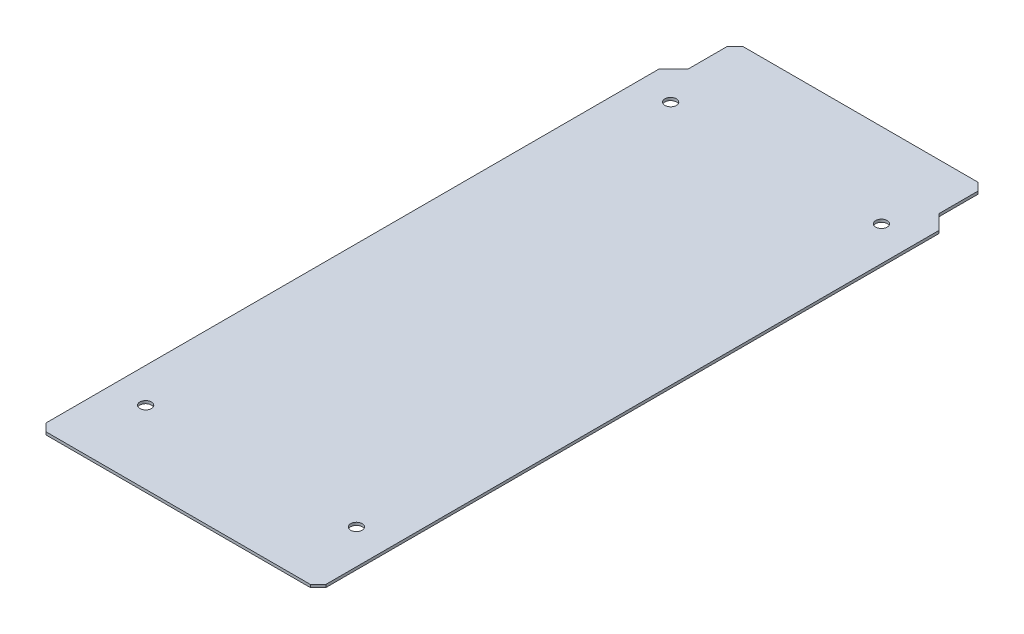
ISO-10303-21;
HEADER;
FILE_DESCRIPTION(('STEP AP214'),'2;1');
FILE_NAME('part.step','',(''),(''),'','','');
FILE_SCHEMA(('AUTOMOTIVE_DESIGN { 1 0 10303 214 1 1 1 1 }'));
ENDSEC;
DATA;
#1=APPLICATION_CONTEXT('core data for automotive mechanical design processes');
#2=APPLICATION_PROTOCOL_DEFINITION('international standard','automotive_design',2000,#1);
#3=PRODUCT_CONTEXT('',#1,'mechanical');
#4=PRODUCT('Part','Part','',(#3));
#5=PRODUCT_RELATED_PRODUCT_CATEGORY('part','',(#4));
#6=PRODUCT_DEFINITION_FORMATION('','',#4);
#7=PRODUCT_DEFINITION_CONTEXT('part definition',#1,'design');
#8=PRODUCT_DEFINITION('design','',#6,#7);
#9=PRODUCT_DEFINITION_SHAPE('','',#8);
#10=(LENGTH_UNIT() NAMED_UNIT(*) SI_UNIT(.MILLI.,.METRE.));
#11=(NAMED_UNIT(*) PLANE_ANGLE_UNIT() SI_UNIT($,.RADIAN.));
#12=(NAMED_UNIT(*) SI_UNIT($,.STERADIAN.) SOLID_ANGLE_UNIT());
#13=UNCERTAINTY_MEASURE_WITH_UNIT(LENGTH_MEASURE(1.E-05),#10,'distance_accuracy_value','');
#14=(GEOMETRIC_REPRESENTATION_CONTEXT(3) GLOBAL_UNCERTAINTY_ASSIGNED_CONTEXT((#13)) GLOBAL_UNIT_ASSIGNED_CONTEXT((#10,
#11,#12)) REPRESENTATION_CONTEXT('',''));
#15=CARTESIAN_POINT('',(0.,0.,0.));
#16=DIRECTION('',(0.,0.,1.));
#17=DIRECTION('',(1.,0.,0.));
#18=AXIS2_PLACEMENT_3D('',#15,#16,#17);
#19=CARTESIAN_POINT('',(0.,0.,0.));
#20=DIRECTION('',(0.,-1.,0.));
#21=DIRECTION('',(0.,0.,-1.));
#22=AXIS2_PLACEMENT_3D('',#19,#20,#21);
#23=PLANE('',#22);
#24=CARTESIAN_POINT('',(34.925,0.,-199.39));
#25=DIRECTION('',(0.,1.,0.));
#26=DIRECTION('',(0.,0.,-1.));
#27=AXIS2_PLACEMENT_3D('',#24,#25,#26);
#28=CIRCLE('',#27,1.905);
#29=CARTESIAN_POINT('',(34.925,0.,-201.295));
#30=VERTEX_POINT('',#29);
#31=EDGE_CURVE('E177',#30,#30,#28,.T.);
#32=ORIENTED_EDGE('',*,*,#31,.T.);
#33=EDGE_LOOP('',(#32));
#34=FACE_BOUND('',#33,.T.);
#35=CARTESIAN_POINT('',(-34.925,0.,-25.4));
#36=DIRECTION('',(0.,1.,0.));
#37=DIRECTION('',(0.,0.,1.));
#38=AXIS2_PLACEMENT_3D('',#35,#36,#37);
#39=CIRCLE('',#38,1.905);
#40=CARTESIAN_POINT('',(-34.925,0.,-23.495));
#41=VERTEX_POINT('',#40);
#42=EDGE_CURVE('E180',#41,#41,#39,.T.);
#43=ORIENTED_EDGE('',*,*,#42,.T.);
#44=EDGE_LOOP('',(#43));
#45=FACE_BOUND('',#44,.T.);
#46=CARTESIAN_POINT('',(-34.925,0.,-199.39));
#47=DIRECTION('',(0.,1.,0.));
#48=DIRECTION('',(0.,0.,1.));
#49=AXIS2_PLACEMENT_3D('',#46,#47,#48);
#50=CIRCLE('',#49,1.905);
#51=CARTESIAN_POINT('',(-34.925,0.,-197.485));
#52=VERTEX_POINT('',#51);
#53=EDGE_CURVE('E193',#52,#52,#50,.T.);
#54=ORIENTED_EDGE('',*,*,#53,.T.);
#55=EDGE_LOOP('',(#54));
#56=FACE_BOUND('',#55,.T.);
#57=CARTESIAN_POINT('',(34.925,0.,-25.4));
#58=DIRECTION('',(0.,1.,0.));
#59=DIRECTION('',(0.,0.,-1.));
#60=AXIS2_PLACEMENT_3D('',#57,#58,#59);
#61=CIRCLE('',#60,1.905);
#62=CARTESIAN_POINT('',(34.925,0.,-27.305));
#63=VERTEX_POINT('',#62);
#64=EDGE_CURVE('E196',#63,#63,#61,.T.);
#65=ORIENTED_EDGE('',*,*,#64,.T.);
#66=EDGE_LOOP('',(#65));
#67=FACE_BOUND('',#66,.T.);
#68=DIRECTION('',(0.,0.,1.));
#69=VECTOR('',#68,1.);
#70=CARTESIAN_POINT('',(-46.355,0.,0.));
#71=LINE('',#70,#69);
#72=CARTESIAN_POINT('',(-46.355,0.,-207.01));
#73=VERTEX_POINT('',#72);
#74=CARTESIAN_POINT('',(-46.355,0.,-3.81000000000004));
#75=VERTEX_POINT('',#74);
#76=EDGE_CURVE('E184',#73,#75,#71,.T.);
#77=ORIENTED_EDGE('',*,*,#76,.F.);
#78=DIRECTION('',(-0.707106781186548,0.,0.707106781186548));
#79=VECTOR('',#78,1.);
#80=CARTESIAN_POINT('',(-126.6825,0.,-126.6825));
#81=LINE('',#80,#79);
#82=CARTESIAN_POINT('',(-41.529,0.,-211.836));
#83=VERTEX_POINT('',#82);
#84=EDGE_CURVE('E159',#83,#73,#81,.T.);
#85=ORIENTED_EDGE('',*,*,#84,.F.);
#86=DIRECTION('',(0.,0.,1.));
#87=VECTOR('',#86,1.);
#88=CARTESIAN_POINT('',(-41.529,0.,-227.33));
#89=LINE('',#88,#87);
#90=CARTESIAN_POINT('',(-41.529,0.,-224.79));
#91=VERTEX_POINT('',#90);
#92=EDGE_CURVE('E142',#91,#83,#89,.T.);
#93=ORIENTED_EDGE('',*,*,#92,.F.);
#94=DIRECTION('',(-0.707106781186546,0.,0.707106781186549));
#95=VECTOR('',#94,1.);
#96=CARTESIAN_POINT('',(-133.1595,0.,-133.159499999999));
#97=LINE('',#96,#95);
#98=CARTESIAN_POINT('',(-38.9889999999999,0.,-227.33));
#99=VERTEX_POINT('',#98);
#100=EDGE_CURVE('E132',#99,#91,#97,.T.);
#101=ORIENTED_EDGE('',*,*,#100,.F.);
#102=DIRECTION('',(-1.,0.,0.));
#103=VECTOR('',#102,1.);
#104=CARTESIAN_POINT('',(-46.355,0.,-227.33));
#105=LINE('',#104,#103);
#106=CARTESIAN_POINT('',(38.9889999999999,0.,-227.33));
#107=VERTEX_POINT('',#106);
#108=EDGE_CURVE('E186',#107,#99,#105,.T.);
#109=ORIENTED_EDGE('',*,*,#108,.F.);
#110=DIRECTION('',(0.707106781186546,0.,0.707106781186549));
#111=VECTOR('',#110,1.);
#112=CARTESIAN_POINT('',(133.1595,0.,-133.159499999999));
#113=LINE('',#112,#111);
#114=CARTESIAN_POINT('',(41.529,0.,-224.79));
#115=VERTEX_POINT('',#114);
#116=EDGE_CURVE('E220',#107,#115,#113,.T.);
#117=ORIENTED_EDGE('',*,*,#116,.T.);
#118=DIRECTION('',(0.,0.,1.));
#119=VECTOR('',#118,1.);
#120=CARTESIAN_POINT('',(41.529,0.,-227.33));
#121=LINE('',#120,#119);
#122=CARTESIAN_POINT('',(41.529,0.,-211.836));
#123=VERTEX_POINT('',#122);
#124=EDGE_CURVE('E170',#115,#123,#121,.T.);
#125=ORIENTED_EDGE('',*,*,#124,.T.);
#126=DIRECTION('',(0.707106781186548,0.,0.707106781186548));
#127=VECTOR('',#126,1.);
#128=CARTESIAN_POINT('',(126.6825,0.,-126.6825));
#129=LINE('',#128,#127);
#130=CARTESIAN_POINT('',(46.355,0.,-207.01));
#131=VERTEX_POINT('',#130);
#132=EDGE_CURVE('E222',#123,#131,#129,.T.);
#133=ORIENTED_EDGE('',*,*,#132,.T.);
#134=DIRECTION('',(0.,0.,-1.));
#135=VECTOR('',#134,1.);
#136=CARTESIAN_POINT('',(46.355,0.,0.));
#137=LINE('',#136,#135);
#138=CARTESIAN_POINT('',(46.355,0.,-3.81000000000004));
#139=VERTEX_POINT('',#138);
#140=EDGE_CURVE('E189',#139,#131,#137,.T.);
#141=ORIENTED_EDGE('',*,*,#140,.F.);
#142=DIRECTION('',(0.707106781186551,0.,-0.707106781186544));
#143=VECTOR('',#142,1.);
#144=CARTESIAN_POINT('',(21.2724999999997,0.,21.2725));
#145=LINE('',#144,#143);
#146=CARTESIAN_POINT('',(43.8149999999999,0.,-1.27));
#147=VERTEX_POINT('',#146);
#148=EDGE_CURVE('E199',#139,#147,#145,.F.);
#149=ORIENTED_EDGE('',*,*,#148,.T.);
#150=DIRECTION('',(-1.,0.,0.));
#151=VECTOR('',#150,1.);
#152=CARTESIAN_POINT('',(-46.355,0.,-1.27));
#153=LINE('',#152,#151);
#154=CARTESIAN_POINT('',(-43.8149999999999,0.,-1.27));
#155=VERTEX_POINT('',#154);
#156=EDGE_CURVE('E192',#155,#147,#153,.F.);
#157=ORIENTED_EDGE('',*,*,#156,.F.);
#158=DIRECTION('',(-0.707106781186551,0.,-0.707106781186544));
#159=VECTOR('',#158,1.);
#160=CARTESIAN_POINT('',(-21.2724999999997,0.,21.2725));
#161=LINE('',#160,#159);
#162=EDGE_CURVE('E165',#75,#155,#161,.F.);
#163=ORIENTED_EDGE('',*,*,#162,.F.);
#164=EDGE_LOOP('',(#77,#85,#93,#101,#109,#117,#125,#133,#141,#149,#157,#163));
#165=FACE_BOUND('',#164,.T.);
#166=ADVANCED_FACE('F39',(#34,#45,#56,#67,#165),#23,.T.);
#167=CARTESIAN_POINT('',(0.,0.9144,0.));
#168=DIRECTION('',(0.,-1.,0.));
#169=DIRECTION('',(0.,0.,-1.));
#170=AXIS2_PLACEMENT_3D('',#167,#168,#169);
#171=PLANE('',#170);
#172=CARTESIAN_POINT('',(34.925,0.9144,-25.4));
#173=DIRECTION('',(0.,1.,0.));
#174=DIRECTION('',(0.,0.,1.));
#175=AXIS2_PLACEMENT_3D('',#172,#173,#174);
#176=CIRCLE('',#175,1.905);
#177=CARTESIAN_POINT('',(34.925,0.9144,-23.495));
#178=VERTEX_POINT('',#177);
#179=EDGE_CURVE('E181',#178,#178,#176,.T.);
#180=ORIENTED_EDGE('',*,*,#179,.F.);
#181=EDGE_LOOP('',(#180));
#182=FACE_BOUND('',#181,.T.);
#183=CARTESIAN_POINT('',(-34.925,0.9144,-199.39));
#184=DIRECTION('',(0.,1.,0.));
#185=DIRECTION('',(0.,0.,1.));
#186=AXIS2_PLACEMENT_3D('',#183,#184,#185);
#187=CIRCLE('',#186,1.905);
#188=CARTESIAN_POINT('',(-34.925,0.9144,-197.485));
#189=VERTEX_POINT('',#188);
#190=EDGE_CURVE('E211',#189,#189,#187,.T.);
#191=ORIENTED_EDGE('',*,*,#190,.F.);
#192=EDGE_LOOP('',(#191));
#193=FACE_BOUND('',#192,.T.);
#194=CARTESIAN_POINT('',(-34.925,0.9144,-25.4));
#195=DIRECTION('',(0.,1.,0.));
#196=DIRECTION('',(0.,0.,1.));
#197=AXIS2_PLACEMENT_3D('',#194,#195,#196);
#198=CIRCLE('',#197,1.905);
#199=CARTESIAN_POINT('',(-34.925,0.9144,-23.495));
#200=VERTEX_POINT('',#199);
#201=EDGE_CURVE('E202',#200,#200,#198,.T.);
#202=ORIENTED_EDGE('',*,*,#201,.F.);
#203=EDGE_LOOP('',(#202));
#204=FACE_BOUND('',#203,.T.);
#205=CARTESIAN_POINT('',(34.925,0.9144,-199.39));
#206=DIRECTION('',(0.,1.,0.));
#207=DIRECTION('',(0.,0.,1.));
#208=AXIS2_PLACEMENT_3D('',#205,#206,#207);
#209=CIRCLE('',#208,1.905);
#210=CARTESIAN_POINT('',(34.925,0.9144,-197.485));
#211=VERTEX_POINT('',#210);
#212=EDGE_CURVE('E174',#211,#211,#209,.T.);
#213=ORIENTED_EDGE('',*,*,#212,.F.);
#214=EDGE_LOOP('',(#213));
#215=FACE_BOUND('',#214,.T.);
#216=DIRECTION('',(0.707106781186548,0.,-0.707106781186548));
#217=VECTOR('',#216,1.);
#218=CARTESIAN_POINT('',(-43.815,0.9144,-209.55));
#219=LINE('',#218,#217);
#220=CARTESIAN_POINT('',(-46.355,0.9144,-207.01));
#221=VERTEX_POINT('',#220);
#222=CARTESIAN_POINT('',(-41.529,0.9144,-211.836));
#223=VERTEX_POINT('',#222);
#224=EDGE_CURVE('E155',#221,#223,#219,.T.);
#225=ORIENTED_EDGE('',*,*,#224,.F.);
#226=DIRECTION('',(0.,0.,-1.));
#227=VECTOR('',#226,1.);
#228=CARTESIAN_POINT('',(-46.355,0.9144,0.));
#229=LINE('',#228,#227);
#230=CARTESIAN_POINT('',(-46.355,0.9144,-3.81000000000004));
#231=VERTEX_POINT('',#230);
#232=EDGE_CURVE('E62',#221,#231,#229,.F.);
#233=ORIENTED_EDGE('',*,*,#232,.T.);
#234=DIRECTION('',(0.707106781186551,0.,0.707106781186544));
#235=VECTOR('',#234,1.);
#236=CARTESIAN_POINT('',(-46.355,0.9144,-3.81000000000004));
#237=LINE('',#236,#235);
#238=CARTESIAN_POINT('',(-43.8149999999999,0.9144,-1.27));
#239=VERTEX_POINT('',#238);
#240=EDGE_CURVE('E161',#239,#231,#237,.F.);
#241=ORIENTED_EDGE('',*,*,#240,.F.);
#242=DIRECTION('',(-1.,0.,0.));
#243=VECTOR('',#242,1.);
#244=CARTESIAN_POINT('',(-46.355,0.9144,-1.27));
#245=LINE('',#244,#243);
#246=CARTESIAN_POINT('',(43.8149999999999,0.9144,-1.27));
#247=VERTEX_POINT('',#246);
#248=EDGE_CURVE('E209',#239,#247,#245,.F.);
#249=ORIENTED_EDGE('',*,*,#248,.T.);
#250=DIRECTION('',(-0.707106781186551,0.,0.707106781186544));
#251=VECTOR('',#250,1.);
#252=CARTESIAN_POINT('',(46.355,0.9144,-3.81000000000004));
#253=LINE('',#252,#251);
#254=CARTESIAN_POINT('',(46.355,0.9144,-3.81000000000004));
#255=VERTEX_POINT('',#254);
#256=EDGE_CURVE('E229',#247,#255,#253,.F.);
#257=ORIENTED_EDGE('',*,*,#256,.T.);
#258=DIRECTION('',(0.,0.,-1.));
#259=VECTOR('',#258,1.);
#260=CARTESIAN_POINT('',(46.355,0.9144,0.));
#261=LINE('',#260,#259);
#262=CARTESIAN_POINT('',(46.355,0.9144,-207.01));
#263=VERTEX_POINT('',#262);
#264=EDGE_CURVE('E206',#255,#263,#261,.T.);
#265=ORIENTED_EDGE('',*,*,#264,.T.);
#266=DIRECTION('',(-0.707106781186548,0.,-0.707106781186548));
#267=VECTOR('',#266,1.);
#268=CARTESIAN_POINT('',(43.815,0.9144,-209.55));
#269=LINE('',#268,#267);
#270=CARTESIAN_POINT('',(41.529,0.9144,-211.836));
#271=VERTEX_POINT('',#270);
#272=EDGE_CURVE('E233',#263,#271,#269,.T.);
#273=ORIENTED_EDGE('',*,*,#272,.T.);
#274=DIRECTION('',(0.,0.,1.));
#275=VECTOR('',#274,1.);
#276=CARTESIAN_POINT('',(41.529,0.9144,-227.33));
#277=LINE('',#276,#275);
#278=CARTESIAN_POINT('',(41.529,0.9144,-224.79));
#279=VERTEX_POINT('',#278);
#280=EDGE_CURVE('E171',#279,#271,#277,.T.);
#281=ORIENTED_EDGE('',*,*,#280,.F.);
#282=DIRECTION('',(-0.707106781186546,0.,-0.707106781186549));
#283=VECTOR('',#282,1.);
#284=CARTESIAN_POINT('',(38.989,0.9144,-227.33));
#285=LINE('',#284,#283);
#286=CARTESIAN_POINT('',(38.989,0.9144,-227.33));
#287=VERTEX_POINT('',#286);
#288=EDGE_CURVE('E231',#279,#287,#285,.T.);
#289=ORIENTED_EDGE('',*,*,#288,.T.);
#290=DIRECTION('',(1.,0.,0.));
#291=VECTOR('',#290,1.);
#292=CARTESIAN_POINT('',(0.,0.9144,-227.33));
#293=LINE('',#292,#291);
#294=CARTESIAN_POINT('',(-38.989,0.9144,-227.33));
#295=VERTEX_POINT('',#294);
#296=EDGE_CURVE('E147',#287,#295,#293,.F.);
#297=ORIENTED_EDGE('',*,*,#296,.T.);
#298=DIRECTION('',(0.707106781186546,0.,-0.707106781186549));
#299=VECTOR('',#298,1.);
#300=CARTESIAN_POINT('',(-38.989,0.9144,-227.33));
#301=LINE('',#300,#299);
#302=CARTESIAN_POINT('',(-41.529,0.9144,-224.79));
#303=VERTEX_POINT('',#302);
#304=EDGE_CURVE('E54',#303,#295,#301,.T.);
#305=ORIENTED_EDGE('',*,*,#304,.F.);
#306=DIRECTION('',(0.,0.,1.));
#307=VECTOR('',#306,1.);
#308=CARTESIAN_POINT('',(-41.529,0.9144,-227.33));
#309=LINE('',#308,#307);
#310=EDGE_CURVE('E138',#303,#223,#309,.T.);
#311=ORIENTED_EDGE('',*,*,#310,.T.);
#312=EDGE_LOOP('',(#225,#233,#241,#249,#257,#265,#273,#281,#289,#297,#305,#311));
#313=FACE_BOUND('',#312,.T.);
#314=ADVANCED_FACE('F145',(#182,#193,#204,#215,#313),#171,.F.);
#315=CARTESIAN_POINT('',(-46.355,0.,0.));
#316=DIRECTION('',(1.,0.,0.));
#317=DIRECTION('',(0.,0.,1.));
#318=AXIS2_PLACEMENT_3D('',#315,#316,#317);
#319=PLANE('',#318);
#320=ORIENTED_EDGE('',*,*,#232,.F.);
#321=DIRECTION('',(0.,-1.,0.));
#322=VECTOR('',#321,1.);
#323=CARTESIAN_POINT('',(-46.355,0.,-207.01));
#324=LINE('',#323,#322);
#325=EDGE_CURVE('E157',#73,#221,#324,.F.);
#326=ORIENTED_EDGE('',*,*,#325,.F.);
#327=ORIENTED_EDGE('',*,*,#76,.T.);
#328=DIRECTION('',(0.,1.,0.));
#329=VECTOR('',#328,1.);
#330=CARTESIAN_POINT('',(-46.355,0.,-3.81000000000004));
#331=LINE('',#330,#329);
#332=EDGE_CURVE('E167',#231,#75,#331,.F.);
#333=ORIENTED_EDGE('',*,*,#332,.F.);
#334=EDGE_LOOP('',(#320,#326,#327,#333));
#335=FACE_BOUND('',#334,.T.);
#336=ADVANCED_FACE('F277',(#335),#319,.F.);
#337=CARTESIAN_POINT('',(-46.355,0.,-227.33));
#338=DIRECTION('',(0.,0.,1.));
#339=DIRECTION('',(-1.,0.,0.));
#340=AXIS2_PLACEMENT_3D('',#337,#338,#339);
#341=PLANE('',#340);
#342=ORIENTED_EDGE('',*,*,#108,.T.);
#343=DIRECTION('',(0.,1.,0.));
#344=VECTOR('',#343,1.);
#345=CARTESIAN_POINT('',(-38.989,0.,-227.33));
#346=LINE('',#345,#344);
#347=EDGE_CURVE('E151',#295,#99,#346,.F.);
#348=ORIENTED_EDGE('',*,*,#347,.F.);
#349=ORIENTED_EDGE('',*,*,#296,.F.);
#350=DIRECTION('',(0.,1.,0.));
#351=VECTOR('',#350,1.);
#352=CARTESIAN_POINT('',(38.989,0.,-227.33));
#353=LINE('',#352,#351);
#354=EDGE_CURVE('E235',#287,#107,#353,.F.);
#355=ORIENTED_EDGE('',*,*,#354,.T.);
#356=EDGE_LOOP('',(#342,#348,#349,#355));
#357=FACE_BOUND('',#356,.T.);
#358=ADVANCED_FACE('F267',(#357),#341,.F.);
#359=CARTESIAN_POINT('',(-46.355,0.,-1.27));
#360=DIRECTION('',(0.,0.,-1.));
#361=DIRECTION('',(1.,0.,0.));
#362=AXIS2_PLACEMENT_3D('',#359,#360,#361);
#363=PLANE('',#362);
#364=ORIENTED_EDGE('',*,*,#248,.F.);
#365=DIRECTION('',(0.,-1.,0.));
#366=VECTOR('',#365,1.);
#367=CARTESIAN_POINT('',(-43.8149999999999,0.,-1.27));
#368=LINE('',#367,#366);
#369=EDGE_CURVE('E163',#155,#239,#368,.F.);
#370=ORIENTED_EDGE('',*,*,#369,.F.);
#371=ORIENTED_EDGE('',*,*,#156,.T.);
#372=DIRECTION('',(0.,-1.,0.));
#373=VECTOR('',#372,1.);
#374=CARTESIAN_POINT('',(43.8149999999999,0.,-1.27));
#375=LINE('',#374,#373);
#376=EDGE_CURVE('E47',#147,#247,#375,.F.);
#377=ORIENTED_EDGE('',*,*,#376,.T.);
#378=EDGE_LOOP('',(#364,#370,#371,#377));
#379=FACE_BOUND('',#378,.T.);
#380=ADVANCED_FACE('F244',(#379),#363,.F.);
#381=CARTESIAN_POINT('',(46.355,0.,0.));
#382=DIRECTION('',(-1.,0.,0.));
#383=DIRECTION('',(0.,0.,-1.));
#384=AXIS2_PLACEMENT_3D('',#381,#382,#383);
#385=PLANE('',#384);
#386=ORIENTED_EDGE('',*,*,#140,.T.);
#387=DIRECTION('',(0.,-1.,0.));
#388=VECTOR('',#387,1.);
#389=CARTESIAN_POINT('',(46.355,0.,-207.01));
#390=LINE('',#389,#388);
#391=EDGE_CURVE('E227',#131,#263,#390,.F.);
#392=ORIENTED_EDGE('',*,*,#391,.T.);
#393=ORIENTED_EDGE('',*,*,#264,.F.);
#394=DIRECTION('',(0.,1.,0.));
#395=VECTOR('',#394,1.);
#396=CARTESIAN_POINT('',(46.355,0.,-3.81000000000004));
#397=LINE('',#396,#395);
#398=EDGE_CURVE('E224',#255,#139,#397,.F.);
#399=ORIENTED_EDGE('',*,*,#398,.T.);
#400=EDGE_LOOP('',(#386,#392,#393,#399));
#401=FACE_BOUND('',#400,.T.);
#402=ADVANCED_FACE('F252',(#401),#385,.F.);
#403=CARTESIAN_POINT('',(34.925,0.,-199.39));
#404=DIRECTION('',(0.,1.,0.));
#405=DIRECTION('',(0.,0.,1.));
#406=AXIS2_PLACEMENT_3D('',#403,#404,#405);
#407=CYLINDRICAL_SURFACE('',#406,1.905);
#408=ORIENTED_EDGE('',*,*,#31,.F.);
#409=EDGE_LOOP('',(#408));
#410=FACE_BOUND('',#409,.T.);
#411=ORIENTED_EDGE('',*,*,#212,.T.);
#412=EDGE_LOOP('',(#411));
#413=FACE_BOUND('',#412,.T.);
#414=ADVANCED_FACE('F304',(#410,#413),#407,.F.);
#415=CARTESIAN_POINT('',(-34.925,0.,-25.4));
#416=DIRECTION('',(0.,1.,0.));
#417=DIRECTION('',(0.,0.,1.));
#418=AXIS2_PLACEMENT_3D('',#415,#416,#417);
#419=CYLINDRICAL_SURFACE('',#418,1.905);
#420=ORIENTED_EDGE('',*,*,#42,.F.);
#421=EDGE_LOOP('',(#420));
#422=FACE_BOUND('',#421,.T.);
#423=ORIENTED_EDGE('',*,*,#201,.T.);
#424=EDGE_LOOP('',(#423));
#425=FACE_BOUND('',#424,.T.);
#426=ADVANCED_FACE('F307',(#422,#425),#419,.F.);
#427=CARTESIAN_POINT('',(-34.925,0.,-199.39));
#428=DIRECTION('',(0.,1.,0.));
#429=DIRECTION('',(0.,0.,1.));
#430=AXIS2_PLACEMENT_3D('',#427,#428,#429);
#431=CYLINDRICAL_SURFACE('',#430,1.905);
#432=ORIENTED_EDGE('',*,*,#53,.F.);
#433=EDGE_LOOP('',(#432));
#434=FACE_BOUND('',#433,.T.);
#435=ORIENTED_EDGE('',*,*,#190,.T.);
#436=EDGE_LOOP('',(#435));
#437=FACE_BOUND('',#436,.T.);
#438=ADVANCED_FACE('F290',(#434,#437),#431,.F.);
#439=CARTESIAN_POINT('',(34.925,0.,-25.4));
#440=DIRECTION('',(0.,1.,0.));
#441=DIRECTION('',(0.,0.,1.));
#442=AXIS2_PLACEMENT_3D('',#439,#440,#441);
#443=CYLINDRICAL_SURFACE('',#442,1.905);
#444=ORIENTED_EDGE('',*,*,#64,.F.);
#445=EDGE_LOOP('',(#444));
#446=FACE_BOUND('',#445,.T.);
#447=ORIENTED_EDGE('',*,*,#179,.T.);
#448=EDGE_LOOP('',(#447));
#449=FACE_BOUND('',#448,.T.);
#450=ADVANCED_FACE('F283',(#446,#449),#443,.F.);
#451=CARTESIAN_POINT('',(41.529,0.9144,-227.33));
#452=DIRECTION('',(1.,0.,0.));
#453=DIRECTION('',(0.,0.,-1.));
#454=AXIS2_PLACEMENT_3D('',#451,#452,#453);
#455=PLANE('',#454);
#456=ORIENTED_EDGE('',*,*,#124,.F.);
#457=DIRECTION('',(0.,1.,0.));
#458=VECTOR('',#457,1.);
#459=CARTESIAN_POINT('',(41.529,0.9144,-224.79));
#460=LINE('',#459,#458);
#461=EDGE_CURVE('E238',#115,#279,#460,.T.);
#462=ORIENTED_EDGE('',*,*,#461,.T.);
#463=ORIENTED_EDGE('',*,*,#280,.T.);
#464=DIRECTION('',(0.,1.,0.));
#465=VECTOR('',#464,1.);
#466=CARTESIAN_POINT('',(41.529,0.9144,-211.836));
#467=LINE('',#466,#465);
#468=EDGE_CURVE('E12',#123,#271,#467,.T.);
#469=ORIENTED_EDGE('',*,*,#468,.F.);
#470=EDGE_LOOP('',(#456,#462,#463,#469));
#471=FACE_BOUND('',#470,.T.);
#472=ADVANCED_FACE('F281',(#471),#455,.T.);
#473=CARTESIAN_POINT('',(43.815,0.9144,-209.55));
#474=DIRECTION('',(0.707106781186548,0.,-0.707106781186548));
#475=DIRECTION('',(0.,1.,0.));
#476=AXIS2_PLACEMENT_3D('',#473,#474,#475);
#477=PLANE('',#476);
#478=ORIENTED_EDGE('',*,*,#272,.F.);
#479=ORIENTED_EDGE('',*,*,#391,.F.);
#480=ORIENTED_EDGE('',*,*,#132,.F.);
#481=ORIENTED_EDGE('',*,*,#468,.T.);
#482=EDGE_LOOP('',(#478,#479,#480,#481));
#483=FACE_BOUND('',#482,.T.);
#484=ADVANCED_FACE('F256',(#483),#477,.T.);
#485=CARTESIAN_POINT('',(38.989,0.,-227.33));
#486=DIRECTION('',(0.707106781186549,0.,-0.707106781186546));
#487=DIRECTION('',(0.,1.,0.));
#488=AXIS2_PLACEMENT_3D('',#485,#486,#487);
#489=PLANE('',#488);
#490=ORIENTED_EDGE('',*,*,#288,.F.);
#491=ORIENTED_EDGE('',*,*,#461,.F.);
#492=ORIENTED_EDGE('',*,*,#116,.F.);
#493=ORIENTED_EDGE('',*,*,#354,.F.);
#494=EDGE_LOOP('',(#490,#491,#492,#493));
#495=FACE_BOUND('',#494,.T.);
#496=ADVANCED_FACE('F264',(#495),#489,.T.);
#497=CARTESIAN_POINT('',(46.355,0.,-3.81000000000004));
#498=DIRECTION('',(-0.707106781186544,0.,-0.707106781186551));
#499=DIRECTION('',(0.,-1.,0.));
#500=AXIS2_PLACEMENT_3D('',#497,#498,#499);
#501=PLANE('',#500);
#502=ORIENTED_EDGE('',*,*,#256,.F.);
#503=ORIENTED_EDGE('',*,*,#376,.F.);
#504=ORIENTED_EDGE('',*,*,#148,.F.);
#505=ORIENTED_EDGE('',*,*,#398,.F.);
#506=EDGE_LOOP('',(#502,#503,#504,#505));
#507=FACE_BOUND('',#506,.T.);
#508=ADVANCED_FACE('F41',(#507),#501,.F.);
#509=CARTESIAN_POINT('',(-46.355,0.,-3.81000000000004));
#510=DIRECTION('',(0.707106781186544,0.,-0.707106781186551));
#511=DIRECTION('',(0.,-1.,0.));
#512=AXIS2_PLACEMENT_3D('',#509,#510,#511);
#513=PLANE('',#512);
#514=ORIENTED_EDGE('',*,*,#240,.T.);
#515=ORIENTED_EDGE('',*,*,#332,.T.);
#516=ORIENTED_EDGE('',*,*,#162,.T.);
#517=ORIENTED_EDGE('',*,*,#369,.T.);
#518=EDGE_LOOP('',(#514,#515,#516,#517));
#519=FACE_BOUND('',#518,.T.);
#520=ADVANCED_FACE('F280',(#519),#513,.F.);
#521=CARTESIAN_POINT('',(-43.815,0.9144,-209.55));
#522=DIRECTION('',(-0.707106781186548,0.,-0.707106781186548));
#523=DIRECTION('',(0.,1.,0.));
#524=AXIS2_PLACEMENT_3D('',#521,#522,#523);
#525=PLANE('',#524);
#526=ORIENTED_EDGE('',*,*,#224,.T.);
#527=DIRECTION('',(0.,1.,0.));
#528=VECTOR('',#527,1.);
#529=CARTESIAN_POINT('',(-41.529,0.9144,-211.836));
#530=LINE('',#529,#528);
#531=EDGE_CURVE('E140',#83,#223,#530,.T.);
#532=ORIENTED_EDGE('',*,*,#531,.F.);
#533=ORIENTED_EDGE('',*,*,#84,.T.);
#534=ORIENTED_EDGE('',*,*,#325,.T.);
#535=EDGE_LOOP('',(#526,#532,#533,#534));
#536=FACE_BOUND('',#535,.T.);
#537=ADVANCED_FACE('F275',(#536),#525,.T.);
#538=CARTESIAN_POINT('',(-41.529,0.9144,-227.33));
#539=DIRECTION('',(-1.,0.,0.));
#540=DIRECTION('',(0.,0.,-1.));
#541=AXIS2_PLACEMENT_3D('',#538,#539,#540);
#542=PLANE('',#541);
#543=ORIENTED_EDGE('',*,*,#92,.T.);
#544=ORIENTED_EDGE('',*,*,#531,.T.);
#545=ORIENTED_EDGE('',*,*,#310,.F.);
#546=DIRECTION('',(0.,1.,0.));
#547=VECTOR('',#546,1.);
#548=CARTESIAN_POINT('',(-41.529,0.9144,-224.79));
#549=LINE('',#548,#547);
#550=EDGE_CURVE('E128',#91,#303,#549,.T.);
#551=ORIENTED_EDGE('',*,*,#550,.F.);
#552=EDGE_LOOP('',(#543,#544,#545,#551));
#553=FACE_BOUND('',#552,.T.);
#554=ADVANCED_FACE('F139',(#553),#542,.T.);
#555=CARTESIAN_POINT('',(-38.989,0.,-227.33));
#556=DIRECTION('',(-0.707106781186549,0.,-0.707106781186546));
#557=DIRECTION('',(0.,1.,0.));
#558=AXIS2_PLACEMENT_3D('',#555,#556,#557);
#559=PLANE('',#558);
#560=ORIENTED_EDGE('',*,*,#304,.T.);
#561=ORIENTED_EDGE('',*,*,#347,.T.);
#562=ORIENTED_EDGE('',*,*,#100,.T.);
#563=ORIENTED_EDGE('',*,*,#550,.T.);
#564=EDGE_LOOP('',(#560,#561,#562,#563));
#565=FACE_BOUND('',#564,.T.);
#566=ADVANCED_FACE('F130',(#565),#559,.T.);
#567=CLOSED_SHELL('',(#166,#314,#336,#358,#380,#402,#414,#426,#438,#450,#472,#484,#496,#508,
#520,#537,#554,#566));
#568=MANIFOLD_SOLID_BREP('B2',#567);
#569=ADVANCED_BREP_SHAPE_REPRESENTATION('',(#18,#568),#14);
#570=SHAPE_DEFINITION_REPRESENTATION(#9,#569);
ENDSEC;
END-ISO-10303-21;
